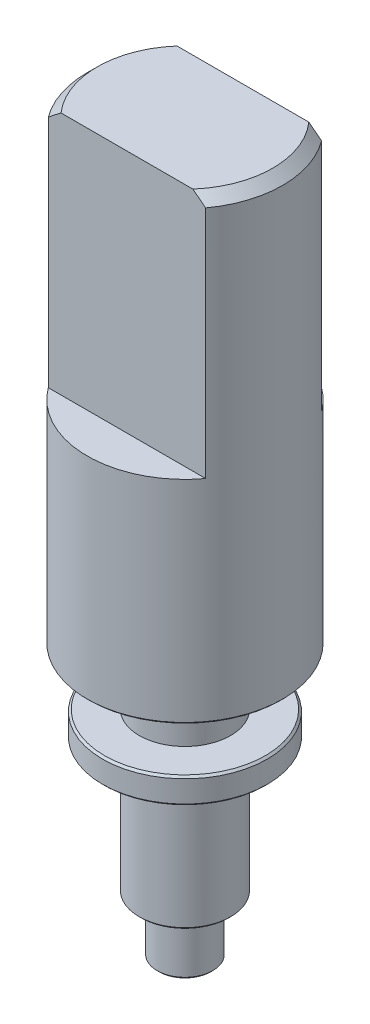
ISO-10303-21;
HEADER;
FILE_DESCRIPTION(('STEP AP214'),'2;1');
FILE_NAME('part.step','',(''),(''),'','','');
FILE_SCHEMA(('AUTOMOTIVE_DESIGN { 1 0 10303 214 1 1 1 1 }'));
ENDSEC;
DATA;
#1=APPLICATION_CONTEXT('core data for automotive mechanical design processes');
#2=APPLICATION_PROTOCOL_DEFINITION('international standard','automotive_design',2000,#1);
#3=PRODUCT_CONTEXT('',#1,'mechanical');
#4=PRODUCT('Part','Part','',(#3));
#5=PRODUCT_RELATED_PRODUCT_CATEGORY('part','',(#4));
#6=PRODUCT_DEFINITION_FORMATION('','',#4);
#7=PRODUCT_DEFINITION_CONTEXT('part definition',#1,'design');
#8=PRODUCT_DEFINITION('design','',#6,#7);
#9=PRODUCT_DEFINITION_SHAPE('','',#8);
#10=(LENGTH_UNIT() NAMED_UNIT(*) SI_UNIT(.MILLI.,.METRE.));
#11=(NAMED_UNIT(*) PLANE_ANGLE_UNIT() SI_UNIT($,.RADIAN.));
#12=(NAMED_UNIT(*) SI_UNIT($,.STERADIAN.) SOLID_ANGLE_UNIT());
#13=UNCERTAINTY_MEASURE_WITH_UNIT(LENGTH_MEASURE(1.E-05),#10,'distance_accuracy_value','');
#14=(GEOMETRIC_REPRESENTATION_CONTEXT(3) GLOBAL_UNCERTAINTY_ASSIGNED_CONTEXT((#13)) GLOBAL_UNIT_ASSIGNED_CONTEXT((#10,
#11,#12)) REPRESENTATION_CONTEXT('',''));
#15=CARTESIAN_POINT('',(0.,0.,0.));
#16=DIRECTION('',(0.,0.,1.));
#17=DIRECTION('',(1.,0.,0.));
#18=AXIS2_PLACEMENT_3D('',#15,#16,#17);
#19=CARTESIAN_POINT('',(-2.46,18.3,0.));
#20=DIRECTION('',(0.,1.,0.));
#21=DIRECTION('',(0.,0.,1.));
#22=AXIS2_PLACEMENT_3D('',#19,#20,#21);
#23=PLANE('',#22);
#24=DIRECTION('',(1.,0.,0.));
#25=VECTOR('',#24,1.);
#26=CARTESIAN_POINT('',(-1.97989898732233,18.3,-1.46));
#27=LINE('',#26,#25);
#28=CARTESIAN_POINT('',(-1.65906600230371,18.3,-1.46));
#29=VERTEX_POINT('',#28);
#30=CARTESIAN_POINT('',(1.65906600230371,18.3,-1.46));
#31=VERTEX_POINT('',#30);
#32=EDGE_CURVE('E97',#29,#31,#27,.T.);
#33=ORIENTED_EDGE('',*,*,#32,.F.);
#34=CARTESIAN_POINT('',(0.,18.3,0.));
#35=DIRECTION('',(0.,1.,0.));
#36=DIRECTION('',(0.,0.,1.));
#37=AXIS2_PLACEMENT_3D('',#34,#35,#36);
#38=CIRCLE('',#37,2.21);
#39=CARTESIAN_POINT('',(-1.65906600230371,18.3,1.46));
#40=VERTEX_POINT('',#39);
#41=EDGE_CURVE('E161',#29,#40,#38,.T.);
#42=ORIENTED_EDGE('',*,*,#41,.T.);
#43=DIRECTION('',(-1.,0.,0.));
#44=VECTOR('',#43,1.);
#45=CARTESIAN_POINT('',(-1.97989898732233,18.3,1.46));
#46=LINE('',#45,#44);
#47=CARTESIAN_POINT('',(1.65906600230371,18.3,1.46));
#48=VERTEX_POINT('',#47);
#49=EDGE_CURVE('E105',#48,#40,#46,.T.);
#50=ORIENTED_EDGE('',*,*,#49,.F.);
#51=CARTESIAN_POINT('',(0.,18.3,0.));
#52=DIRECTION('',(0.,1.,0.));
#53=DIRECTION('',(0.,0.,1.));
#54=AXIS2_PLACEMENT_3D('',#51,#52,#53);
#55=CIRCLE('',#54,2.21);
#56=EDGE_CURVE('E420',#48,#31,#55,.T.);
#57=ORIENTED_EDGE('',*,*,#56,.T.);
#58=EDGE_LOOP('',(#33,#42,#50,#57));
#59=FACE_BOUND('',#58,.T.);
#60=ADVANCED_FACE('F37',(#59),#23,.T.);
#61=CARTESIAN_POINT('',(0.,0.,0.));
#62=DIRECTION('',(0.,-1.,0.));
#63=DIRECTION('',(0.,0.,-1.));
#64=AXIS2_PLACEMENT_3D('',#61,#62,#63);
#65=PLANE('',#64);
#66=CARTESIAN_POINT('',(0.,0.,0.));
#67=DIRECTION('',(0.,-1.,0.));
#68=DIRECTION('',(0.,0.,-1.));
#69=AXIS2_PLACEMENT_3D('',#66,#67,#68);
#70=CIRCLE('',#69,0.649999999999996);
#71=CARTESIAN_POINT('',(0.,0.,-0.649999999999996));
#72=VERTEX_POINT('',#71);
#73=EDGE_CURVE('E12',#72,#72,#70,.T.);
#74=ORIENTED_EDGE('',*,*,#73,.T.);
#75=EDGE_LOOP('',(#74));
#76=FACE_BOUND('',#75,.T.);
#77=ADVANCED_FACE('F219',(#76),#65,.T.);
#78=CARTESIAN_POINT('',(0.,18.3,0.));
#79=DIRECTION('',(0.,1.,0.));
#80=DIRECTION('',(0.,0.,1.));
#81=AXIS2_PLACEMENT_3D('',#78,#79,#80);
#82=CYLINDRICAL_SURFACE('',#81,0.699999999999998);
#83=CARTESIAN_POINT('',(0.,0.0500000000000014,0.));
#84=DIRECTION('',(0.,-1.,0.));
#85=DIRECTION('',(0.,0.,-1.));
#86=AXIS2_PLACEMENT_3D('',#83,#84,#85);
#87=CIRCLE('',#86,0.699999999999998);
#88=CARTESIAN_POINT('',(0.,0.0500000000000014,-0.699999999999998));
#89=VERTEX_POINT('',#88);
#90=EDGE_CURVE('E46',#89,#89,#87,.F.);
#91=ORIENTED_EDGE('',*,*,#90,.T.);
#92=EDGE_LOOP('',(#91));
#93=FACE_BOUND('',#92,.T.);
#94=CARTESIAN_POINT('',(0.,1.4,0.));
#95=DIRECTION('',(0.,1.,0.));
#96=DIRECTION('',(0.,0.,1.));
#97=AXIS2_PLACEMENT_3D('',#94,#95,#96);
#98=CIRCLE('',#97,0.699999999999998);
#99=CARTESIAN_POINT('',(0.,1.4,0.699999999999998));
#100=VERTEX_POINT('',#99);
#101=EDGE_CURVE('E440',#100,#100,#98,.T.);
#102=ORIENTED_EDGE('',*,*,#101,.F.);
#103=EDGE_LOOP('',(#102));
#104=FACE_BOUND('',#103,.T.);
#105=ADVANCED_FACE('F215',(#93,#104),#82,.T.);
#106=CARTESIAN_POINT('',(-0.699999999999998,1.4,0.));
#107=DIRECTION('',(0.,-1.,0.));
#108=DIRECTION('',(0.,0.,-1.));
#109=AXIS2_PLACEMENT_3D('',#106,#107,#108);
#110=PLANE('',#109);
#111=CARTESIAN_POINT('',(0.,1.4,0.));
#112=DIRECTION('',(0.,-1.,0.));
#113=DIRECTION('',(0.,0.,-1.));
#114=AXIS2_PLACEMENT_3D('',#111,#112,#113);
#115=CIRCLE('',#114,1.1);
#116=CARTESIAN_POINT('',(0.,1.4,-1.1));
#117=VERTEX_POINT('',#116);
#118=EDGE_CURVE('E473',#117,#117,#115,.T.);
#119=ORIENTED_EDGE('',*,*,#118,.T.);
#120=EDGE_LOOP('',(#119));
#121=FACE_BOUND('',#120,.T.);
#122=ORIENTED_EDGE('',*,*,#101,.T.);
#123=EDGE_LOOP('',(#122));
#124=FACE_BOUND('',#123,.T.);
#125=ADVANCED_FACE('F211',(#121,#124),#110,.T.);
#126=CARTESIAN_POINT('',(0.,18.3,0.));
#127=DIRECTION('',(0.,1.,0.));
#128=DIRECTION('',(0.,0.,1.));
#129=AXIS2_PLACEMENT_3D('',#126,#127,#128);
#130=CYLINDRICAL_SURFACE('',#129,1.15);
#131=CARTESIAN_POINT('',(0.,1.45,0.));
#132=DIRECTION('',(0.,-1.,0.));
#133=DIRECTION('',(0.,0.,-1.));
#134=AXIS2_PLACEMENT_3D('',#131,#132,#133);
#135=CIRCLE('',#134,1.15);
#136=CARTESIAN_POINT('',(0.,1.45,-1.15));
#137=VERTEX_POINT('',#136);
#138=EDGE_CURVE('E454',#137,#137,#135,.F.);
#139=ORIENTED_EDGE('',*,*,#138,.T.);
#140=EDGE_LOOP('',(#139));
#141=FACE_BOUND('',#140,.T.);
#142=CARTESIAN_POINT('',(0.,4.75,0.));
#143=DIRECTION('',(0.,1.,0.));
#144=DIRECTION('',(0.,0.,1.));
#145=AXIS2_PLACEMENT_3D('',#142,#143,#144);
#146=CIRCLE('',#145,1.15);
#147=CARTESIAN_POINT('',(0.,4.75,1.15));
#148=VERTEX_POINT('',#147);
#149=EDGE_CURVE('E467',#148,#148,#146,.T.);
#150=ORIENTED_EDGE('',*,*,#149,.F.);
#151=EDGE_LOOP('',(#150));
#152=FACE_BOUND('',#151,.T.);
#153=ADVANCED_FACE('F207',(#141,#152),#130,.T.);
#154=CARTESIAN_POINT('',(-1.15,4.75,0.));
#155=DIRECTION('',(0.,-1.,0.));
#156=DIRECTION('',(0.,0.,-1.));
#157=AXIS2_PLACEMENT_3D('',#154,#155,#156);
#158=PLANE('',#157);
#159=CARTESIAN_POINT('',(0.,4.75,0.));
#160=DIRECTION('',(0.,-1.,0.));
#161=DIRECTION('',(0.,0.,-1.));
#162=AXIS2_PLACEMENT_3D('',#159,#160,#161);
#163=CIRCLE('',#162,2.025);
#164=CARTESIAN_POINT('',(0.,4.75,-2.025));
#165=VERTEX_POINT('',#164);
#166=EDGE_CURVE('E483',#165,#165,#163,.T.);
#167=ORIENTED_EDGE('',*,*,#166,.T.);
#168=EDGE_LOOP('',(#167));
#169=FACE_BOUND('',#168,.T.);
#170=ORIENTED_EDGE('',*,*,#149,.T.);
#171=EDGE_LOOP('',(#170));
#172=FACE_BOUND('',#171,.T.);
#173=ADVANCED_FACE('F203',(#169,#172),#158,.T.);
#174=CARTESIAN_POINT('',(0.,18.3,0.));
#175=DIRECTION('',(0.,1.,0.));
#176=DIRECTION('',(0.,0.,1.));
#177=AXIS2_PLACEMENT_3D('',#174,#175,#176);
#178=CYLINDRICAL_SURFACE('',#177,2.075);
#179=CARTESIAN_POINT('',(0.,5.35,0.));
#180=DIRECTION('',(0.,1.,0.));
#181=DIRECTION('',(0.,0.,1.));
#182=AXIS2_PLACEMENT_3D('',#179,#180,#181);
#183=CIRCLE('',#182,2.075);
#184=CARTESIAN_POINT('',(0.,5.35,2.075));
#185=VERTEX_POINT('',#184);
#186=EDGE_CURVE('E487',#185,#185,#183,.F.);
#187=ORIENTED_EDGE('',*,*,#186,.T.);
#188=EDGE_LOOP('',(#187));
#189=FACE_BOUND('',#188,.T.);
#190=CARTESIAN_POINT('',(0.,4.8,0.));
#191=DIRECTION('',(0.,-1.,0.));
#192=DIRECTION('',(0.,0.,-1.));
#193=AXIS2_PLACEMENT_3D('',#190,#191,#192);
#194=CIRCLE('',#193,2.075);
#195=CARTESIAN_POINT('',(0.,4.8,-2.075));
#196=VERTEX_POINT('',#195);
#197=EDGE_CURVE('E503',#196,#196,#194,.F.);
#198=ORIENTED_EDGE('',*,*,#197,.T.);
#199=EDGE_LOOP('',(#198));
#200=FACE_BOUND('',#199,.T.);
#201=ADVANCED_FACE('F199',(#189,#200),#178,.T.);
#202=CARTESIAN_POINT('',(-2.075,5.4,0.));
#203=DIRECTION('',(0.,1.,0.));
#204=DIRECTION('',(0.,0.,1.));
#205=AXIS2_PLACEMENT_3D('',#202,#203,#204);
#206=PLANE('',#205);
#207=CARTESIAN_POINT('',(0.,5.4,0.));
#208=DIRECTION('',(0.,1.,0.));
#209=DIRECTION('',(0.,0.,1.));
#210=AXIS2_PLACEMENT_3D('',#207,#208,#209);
#211=CIRCLE('',#210,2.025);
#212=CARTESIAN_POINT('',(0.,5.4,2.025));
#213=VERTEX_POINT('',#212);
#214=EDGE_CURVE('E476',#213,#213,#211,.T.);
#215=ORIENTED_EDGE('',*,*,#214,.T.);
#216=EDGE_LOOP('',(#215));
#217=FACE_BOUND('',#216,.T.);
#218=CARTESIAN_POINT('',(0.,5.4,0.));
#219=DIRECTION('',(0.,1.,0.));
#220=DIRECTION('',(0.,0.,1.));
#221=AXIS2_PLACEMENT_3D('',#218,#219,#220);
#222=CIRCLE('',#221,1.15);
#223=CARTESIAN_POINT('',(0.,5.4,1.15));
#224=VERTEX_POINT('',#223);
#225=EDGE_CURVE('E464',#224,#224,#222,.T.);
#226=ORIENTED_EDGE('',*,*,#225,.F.);
#227=EDGE_LOOP('',(#226));
#228=FACE_BOUND('',#227,.T.);
#229=ADVANCED_FACE('F195',(#217,#228),#206,.T.);
#230=CARTESIAN_POINT('',(0.,18.3,0.));
#231=DIRECTION('',(0.,1.,0.));
#232=DIRECTION('',(0.,0.,1.));
#233=AXIS2_PLACEMENT_3D('',#230,#231,#232);
#234=CYLINDRICAL_SURFACE('',#233,1.15);
#235=ORIENTED_EDGE('',*,*,#225,.T.);
#236=EDGE_LOOP('',(#235));
#237=FACE_BOUND('',#236,.T.);
#238=CARTESIAN_POINT('',(0.,6.8,0.));
#239=DIRECTION('',(0.,1.,0.));
#240=DIRECTION('',(0.,0.,1.));
#241=AXIS2_PLACEMENT_3D('',#238,#239,#240);
#242=CIRCLE('',#241,1.15);
#243=CARTESIAN_POINT('',(0.,6.8,1.15));
#244=VERTEX_POINT('',#243);
#245=EDGE_CURVE('E141',#244,#244,#242,.T.);
#246=ORIENTED_EDGE('',*,*,#245,.F.);
#247=EDGE_LOOP('',(#246));
#248=FACE_BOUND('',#247,.T.);
#249=ADVANCED_FACE('F191',(#237,#248),#234,.T.);
#250=CARTESIAN_POINT('',(-1.15,6.8,0.));
#251=DIRECTION('',(0.,-1.,0.));
#252=DIRECTION('',(0.,0.,-1.));
#253=AXIS2_PLACEMENT_3D('',#250,#251,#252);
#254=PLANE('',#253);
#255=CARTESIAN_POINT('',(0.,6.8,0.));
#256=DIRECTION('',(0.,-1.,0.));
#257=DIRECTION('',(0.,0.,-1.));
#258=AXIS2_PLACEMENT_3D('',#255,#256,#257);
#259=CIRCLE('',#258,2.40999999999999);
#260=CARTESIAN_POINT('',(0.,6.8,-2.40999999999999));
#261=VERTEX_POINT('',#260);
#262=EDGE_CURVE('E450',#261,#261,#259,.T.);
#263=ORIENTED_EDGE('',*,*,#262,.T.);
#264=EDGE_LOOP('',(#263));
#265=FACE_BOUND('',#264,.T.);
#266=ORIENTED_EDGE('',*,*,#245,.T.);
#267=EDGE_LOOP('',(#266));
#268=FACE_BOUND('',#267,.T.);
#269=ADVANCED_FACE('F187',(#265,#268),#254,.T.);
#270=CARTESIAN_POINT('',(0.,18.3,0.));
#271=DIRECTION('',(0.,1.,0.));
#272=DIRECTION('',(0.,0.,1.));
#273=AXIS2_PLACEMENT_3D('',#270,#271,#272);
#274=CYLINDRICAL_SURFACE('',#273,2.46);
#275=CARTESIAN_POINT('',(0.,6.85,0.));
#276=DIRECTION('',(0.,-1.,0.));
#277=DIRECTION('',(0.,0.,-1.));
#278=AXIS2_PLACEMENT_3D('',#275,#276,#277);
#279=CIRCLE('',#278,2.46);
#280=CARTESIAN_POINT('',(0.,6.85,-2.46));
#281=VERTEX_POINT('',#280);
#282=EDGE_CURVE('E239',#281,#281,#279,.F.);
#283=ORIENTED_EDGE('',*,*,#282,.T.);
#284=EDGE_LOOP('',(#283));
#285=FACE_BOUND('',#284,.T.);
#286=DIRECTION('',(0.,1.,0.));
#287=VECTOR('',#286,1.);
#288=CARTESIAN_POINT('',(-1.97989898732233,12.15,1.46));
#289=LINE('',#288,#287);
#290=CARTESIAN_POINT('',(-1.97989898732233,12.15,1.46));
#291=VERTEX_POINT('',#290);
#292=CARTESIAN_POINT('',(-1.97989898732233,18.05,1.46));
#293=VERTEX_POINT('',#292);
#294=EDGE_CURVE('E137',#291,#293,#289,.T.);
#295=ORIENTED_EDGE('',*,*,#294,.T.);
#296=CARTESIAN_POINT('',(0.,18.05,0.));
#297=DIRECTION('',(0.,1.,0.));
#298=DIRECTION('',(0.,0.,1.));
#299=AXIS2_PLACEMENT_3D('',#296,#297,#298);
#300=CIRCLE('',#299,2.46);
#301=CARTESIAN_POINT('',(-1.97989898732233,18.05,-1.46));
#302=VERTEX_POINT('',#301);
#303=EDGE_CURVE('E53',#293,#302,#300,.F.);
#304=ORIENTED_EDGE('',*,*,#303,.T.);
#305=DIRECTION('',(0.,1.,0.));
#306=VECTOR('',#305,1.);
#307=CARTESIAN_POINT('',(-1.97989898732233,12.15,-1.46));
#308=LINE('',#307,#306);
#309=CARTESIAN_POINT('',(-1.97989898732233,12.15,-1.46));
#310=VERTEX_POINT('',#309);
#311=EDGE_CURVE('E100',#310,#302,#308,.T.);
#312=ORIENTED_EDGE('',*,*,#311,.F.);
#313=CARTESIAN_POINT('',(0.,12.15,0.));
#314=DIRECTION('',(0.,1.,0.));
#315=DIRECTION('',(0.,0.,1.));
#316=AXIS2_PLACEMENT_3D('',#313,#314,#315);
#317=CIRCLE('',#316,2.46);
#318=CARTESIAN_POINT('',(1.97989898732233,12.15,-1.46));
#319=VERTEX_POINT('',#318);
#320=EDGE_CURVE('E93',#319,#310,#317,.T.);
#321=ORIENTED_EDGE('',*,*,#320,.F.);
#322=DIRECTION('',(0.,1.,0.));
#323=VECTOR('',#322,1.);
#324=CARTESIAN_POINT('',(1.97989898732233,12.15,-1.46));
#325=LINE('',#324,#323);
#326=CARTESIAN_POINT('',(1.97989898732233,18.05,-1.46));
#327=VERTEX_POINT('',#326);
#328=EDGE_CURVE('E102',#319,#327,#325,.T.);
#329=ORIENTED_EDGE('',*,*,#328,.T.);
#330=CARTESIAN_POINT('',(0.,18.05,0.));
#331=DIRECTION('',(0.,1.,0.));
#332=DIRECTION('',(0.,0.,1.));
#333=AXIS2_PLACEMENT_3D('',#330,#331,#332);
#334=CIRCLE('',#333,2.46);
#335=CARTESIAN_POINT('',(1.97989898732233,18.05,1.46));
#336=VERTEX_POINT('',#335);
#337=EDGE_CURVE('E413',#327,#336,#334,.F.);
#338=ORIENTED_EDGE('',*,*,#337,.T.);
#339=DIRECTION('',(0.,1.,0.));
#340=VECTOR('',#339,1.);
#341=CARTESIAN_POINT('',(1.97989898732233,12.15,1.46));
#342=LINE('',#341,#340);
#343=CARTESIAN_POINT('',(1.97989898732233,12.15,1.46));
#344=VERTEX_POINT('',#343);
#345=EDGE_CURVE('E133',#344,#336,#342,.T.);
#346=ORIENTED_EDGE('',*,*,#345,.F.);
#347=CARTESIAN_POINT('',(0.,12.15,0.));
#348=DIRECTION('',(0.,1.,0.));
#349=DIRECTION('',(0.,0.,1.));
#350=AXIS2_PLACEMENT_3D('',#347,#348,#349);
#351=CIRCLE('',#350,2.46);
#352=EDGE_CURVE('E111',#291,#344,#351,.T.);
#353=ORIENTED_EDGE('',*,*,#352,.F.);
#354=EDGE_LOOP('',(#295,#304,#312,#321,#329,#338,#346,#353));
#355=FACE_BOUND('',#354,.T.);
#356=ADVANCED_FACE('F103',(#285,#355),#274,.T.);
#357=CARTESIAN_POINT('',(-1.97989898732233,12.15,1.46));
#358=DIRECTION('',(0.,0.,-1.));
#359=DIRECTION('',(-1.,0.,0.));
#360=AXIS2_PLACEMENT_3D('',#357,#358,#359);
#361=PLANE('',#360);
#362=ORIENTED_EDGE('',*,*,#49,.T.);
#363=CARTESIAN_POINT('',(-1.65906600230371,18.3,1.46));
#364=CARTESIAN_POINT('',(-1.68617458978429,18.2796484395284,1.46));
#365=CARTESIAN_POINT('',(-1.71317928404995,18.2591590177984,1.46));
#366=CARTESIAN_POINT('',(-1.76699585580801,18.217932332114,1.46));
#367=CARTESIAN_POINT('',(-1.79380774678302,18.1971950857651,1.46));
#368=CARTESIAN_POINT('',(-1.84725720985176,18.1554979799921,1.46));
#369=CARTESIAN_POINT('',(-1.87389478387278,18.134538123036,1.46));
#370=CARTESIAN_POINT('',(-1.92701213315352,18.0924155188503,1.46));
#371=CARTESIAN_POINT('',(-1.95349189714086,18.0712527574024,1.46));
#372=CARTESIAN_POINT('',(-1.97989898732235,18.05,1.46));
#373=B_SPLINE_CURVE_WITH_KNOTS('',3,(#363,#364,#365,#366,#367,#368,#369,#370,#371,#372),
.UNSPECIFIED.,.F.,.F.,(4,2,2,2,4),(0.,0.101692536253413,0.203377890674927,0.305062118932271,
0.406753525481858),.UNSPECIFIED.);
#374=EDGE_CURVE('E160',#40,#293,#373,.T.);
#375=ORIENTED_EDGE('',*,*,#374,.T.);
#376=ORIENTED_EDGE('',*,*,#294,.F.);
#377=DIRECTION('',(-1.,0.,0.));
#378=VECTOR('',#377,1.);
#379=CARTESIAN_POINT('',(-1.97989898732233,12.15,1.46));
#380=LINE('',#379,#378);
#381=EDGE_CURVE('E138',#344,#291,#380,.T.);
#382=ORIENTED_EDGE('',*,*,#381,.F.);
#383=ORIENTED_EDGE('',*,*,#345,.T.);
#384=CARTESIAN_POINT('',(1.97989898732233,18.05,1.46));
#385=CARTESIAN_POINT('',(1.95349189714085,18.0712527574024,1.46));
#386=CARTESIAN_POINT('',(1.92701213315352,18.0924155188503,1.46));
#387=CARTESIAN_POINT('',(1.87389478387278,18.134538123036,1.46));
#388=CARTESIAN_POINT('',(1.84725720985176,18.1554979799921,1.46));
#389=CARTESIAN_POINT('',(1.79380774678302,18.1971950857651,1.46));
#390=CARTESIAN_POINT('',(1.76699585580801,18.2179323321139,1.46));
#391=CARTESIAN_POINT('',(1.71317928404995,18.2591590177984,1.46));
#392=CARTESIAN_POINT('',(1.6861745897843,18.2796484395284,1.46));
#393=CARTESIAN_POINT('',(1.65906600230374,18.3,1.46));
#394=B_SPLINE_CURVE_WITH_KNOTS('',3,(#384,#385,#386,#387,#388,#389,#390,#391,#392,#393),
.UNSPECIFIED.,.F.,.F.,(4,2,2,2,4),(0.,0.101691406549585,0.203375634806927,0.305060989228441,
0.406753525481854),.UNSPECIFIED.);
#395=EDGE_CURVE('E150',#336,#48,#394,.T.);
#396=ORIENTED_EDGE('',*,*,#395,.T.);
#397=EDGE_LOOP('',(#362,#375,#376,#382,#383,#396));
#398=FACE_BOUND('',#397,.T.);
#399=ADVANCED_FACE('F176',(#398),#361,.F.);
#400=CARTESIAN_POINT('',(0.,12.15,0.));
#401=DIRECTION('',(0.,1.,0.));
#402=DIRECTION('',(0.,0.,1.));
#403=AXIS2_PLACEMENT_3D('',#400,#401,#402);
#404=PLANE('',#403);
#405=ORIENTED_EDGE('',*,*,#352,.T.);
#406=ORIENTED_EDGE('',*,*,#381,.T.);
#407=EDGE_LOOP('',(#405,#406));
#408=FACE_BOUND('',#407,.T.);
#409=ADVANCED_FACE('F181',(#408),#404,.T.);
#410=CARTESIAN_POINT('',(-1.97989898732233,12.15,-1.46));
#411=DIRECTION('',(0.,0.,1.));
#412=DIRECTION('',(1.,0.,0.));
#413=AXIS2_PLACEMENT_3D('',#410,#411,#412);
#414=PLANE('',#413);
#415=ORIENTED_EDGE('',*,*,#311,.T.);
#416=CARTESIAN_POINT('',(-1.97989898732233,18.05,-1.46));
#417=CARTESIAN_POINT('',(-1.95349189714085,18.0712527574024,-1.46));
#418=CARTESIAN_POINT('',(-1.92701213315352,18.0924155188503,-1.46));
#419=CARTESIAN_POINT('',(-1.87389478387278,18.134538123036,-1.46));
#420=CARTESIAN_POINT('',(-1.84725720985176,18.1554979799921,-1.46));
#421=CARTESIAN_POINT('',(-1.79380774678302,18.1971950857651,-1.46));
#422=CARTESIAN_POINT('',(-1.76699585580801,18.2179323321139,-1.46));
#423=CARTESIAN_POINT('',(-1.71317928404996,18.2591590177984,-1.46));
#424=CARTESIAN_POINT('',(-1.6861745897843,18.2796484395284,-1.46));
#425=CARTESIAN_POINT('',(-1.65906600230374,18.3,-1.46));
#426=B_SPLINE_CURVE_WITH_KNOTS('',3,(#416,#417,#418,#419,#420,#421,#422,#423,#424,#425),
.UNSPECIFIED.,.F.,.F.,(4,2,2,2,4),(0.,0.101691406549585,0.203375634806927,0.305060989228437,
0.406753525481854),.UNSPECIFIED.);
#427=EDGE_CURVE('E232',#302,#29,#426,.T.);
#428=ORIENTED_EDGE('',*,*,#427,.T.);
#429=ORIENTED_EDGE('',*,*,#32,.T.);
#430=CARTESIAN_POINT('',(1.65906600230371,18.3,-1.46));
#431=CARTESIAN_POINT('',(1.68617458978429,18.2796484395284,-1.46));
#432=CARTESIAN_POINT('',(1.71317928404995,18.2591590177984,-1.46));
#433=CARTESIAN_POINT('',(1.76699585580801,18.217932332114,-1.46));
#434=CARTESIAN_POINT('',(1.79380774678302,18.1971950857651,-1.46));
#435=CARTESIAN_POINT('',(1.84725720985176,18.1554979799921,-1.46));
#436=CARTESIAN_POINT('',(1.87389478387278,18.134538123036,-1.46));
#437=CARTESIAN_POINT('',(1.92701213315352,18.0924155188503,-1.46));
#438=CARTESIAN_POINT('',(1.95349189714086,18.0712527574024,-1.46));
#439=CARTESIAN_POINT('',(1.97989898732235,18.05,-1.46));
#440=B_SPLINE_CURVE_WITH_KNOTS('',3,(#430,#431,#432,#433,#434,#435,#436,#437,#438,#439),
.UNSPECIFIED.,.F.,.F.,(4,2,2,2,4),(0.,0.101692536253413,0.203377890674927,0.305062118932271,
0.406753525481858),.UNSPECIFIED.);
#441=EDGE_CURVE('E61',#31,#327,#440,.T.);
#442=ORIENTED_EDGE('',*,*,#441,.T.);
#443=ORIENTED_EDGE('',*,*,#328,.F.);
#444=DIRECTION('',(1.,0.,0.));
#445=VECTOR('',#444,1.);
#446=CARTESIAN_POINT('',(-1.97989898732233,12.15,-1.46));
#447=LINE('',#446,#445);
#448=EDGE_CURVE('E96',#310,#319,#447,.T.);
#449=ORIENTED_EDGE('',*,*,#448,.F.);
#450=EDGE_LOOP('',(#415,#428,#429,#442,#443,#449));
#451=FACE_BOUND('',#450,.T.);
#452=ADVANCED_FACE('F99',(#451),#414,.F.);
#453=CARTESIAN_POINT('',(0.,12.15,0.));
#454=DIRECTION('',(0.,1.,0.));
#455=DIRECTION('',(0.,0.,1.));
#456=AXIS2_PLACEMENT_3D('',#453,#454,#455);
#457=PLANE('',#456);
#458=ORIENTED_EDGE('',*,*,#320,.T.);
#459=ORIENTED_EDGE('',*,*,#448,.T.);
#460=EDGE_LOOP('',(#458,#459));
#461=FACE_BOUND('',#460,.T.);
#462=ADVANCED_FACE('F95',(#461),#457,.T.);
#463=CARTESIAN_POINT('',(0.,18.3,0.));
#464=DIRECTION('',(0.,-1.,0.));
#465=DIRECTION('',(0.,0.,-1.));
#466=AXIS2_PLACEMENT_3D('',#463,#464,#465);
#467=CONICAL_SURFACE('',#466,2.21,0.785398163397447);
#468=ORIENTED_EDGE('',*,*,#427,.F.);
#469=ORIENTED_EDGE('',*,*,#303,.F.);
#470=ORIENTED_EDGE('',*,*,#374,.F.);
#471=ORIENTED_EDGE('',*,*,#41,.F.);
#472=EDGE_LOOP('',(#468,#469,#470,#471));
#473=FACE_BOUND('',#472,.T.);
#474=ADVANCED_FACE('F226',(#473),#467,.T.);
#475=CARTESIAN_POINT('',(0.,18.3,0.));
#476=DIRECTION('',(0.,-1.,0.));
#477=DIRECTION('',(0.,0.,-1.));
#478=AXIS2_PLACEMENT_3D('',#475,#476,#477);
#479=CONICAL_SURFACE('',#478,2.21,0.785398163397447);
#480=ORIENTED_EDGE('',*,*,#395,.F.);
#481=ORIENTED_EDGE('',*,*,#337,.F.);
#482=ORIENTED_EDGE('',*,*,#441,.F.);
#483=ORIENTED_EDGE('',*,*,#56,.F.);
#484=EDGE_LOOP('',(#480,#481,#482,#483));
#485=FACE_BOUND('',#484,.T.);
#486=ADVANCED_FACE('F173',(#485),#479,.T.);
#487=CARTESIAN_POINT('',(0.,6.85,0.));
#488=DIRECTION('',(0.,1.,0.));
#489=DIRECTION('',(0.,0.,1.));
#490=AXIS2_PLACEMENT_3D('',#487,#488,#489);
#491=CONICAL_SURFACE('',#490,2.46,0.785398163397461);
#492=ORIENTED_EDGE('',*,*,#262,.F.);
#493=EDGE_LOOP('',(#492));
#494=FACE_BOUND('',#493,.T.);
#495=ORIENTED_EDGE('',*,*,#282,.F.);
#496=EDGE_LOOP('',(#495));
#497=FACE_BOUND('',#496,.T.);
#498=ADVANCED_FACE('F271',(#494,#497),#491,.T.);
#499=CARTESIAN_POINT('',(0.,1.45,0.));
#500=DIRECTION('',(0.,1.,0.));
#501=DIRECTION('',(0.,0.,1.));
#502=AXIS2_PLACEMENT_3D('',#499,#500,#501);
#503=CONICAL_SURFACE('',#502,1.15,0.785398163397409);
#504=ORIENTED_EDGE('',*,*,#118,.F.);
#505=EDGE_LOOP('',(#504));
#506=FACE_BOUND('',#505,.T.);
#507=ORIENTED_EDGE('',*,*,#138,.F.);
#508=EDGE_LOOP('',(#507));
#509=FACE_BOUND('',#508,.T.);
#510=ADVANCED_FACE('F279',(#506,#509),#503,.T.);
#511=CARTESIAN_POINT('',(0.,5.4,0.));
#512=DIRECTION('',(0.,-1.,0.));
#513=DIRECTION('',(0.,0.,-1.));
#514=AXIS2_PLACEMENT_3D('',#511,#512,#513);
#515=CONICAL_SURFACE('',#514,2.025,0.78539816339744);
#516=ORIENTED_EDGE('',*,*,#186,.F.);
#517=EDGE_LOOP('',(#516));
#518=FACE_BOUND('',#517,.T.);
#519=ORIENTED_EDGE('',*,*,#214,.F.);
#520=EDGE_LOOP('',(#519));
#521=FACE_BOUND('',#520,.T.);
#522=ADVANCED_FACE('F287',(#518,#521),#515,.T.);
#523=CARTESIAN_POINT('',(0.,4.8,0.));
#524=DIRECTION('',(0.,1.,0.));
#525=DIRECTION('',(0.,0.,1.));
#526=AXIS2_PLACEMENT_3D('',#523,#524,#525);
#527=CONICAL_SURFACE('',#526,2.075,0.785398163397457);
#528=ORIENTED_EDGE('',*,*,#166,.F.);
#529=EDGE_LOOP('',(#528));
#530=FACE_BOUND('',#529,.T.);
#531=ORIENTED_EDGE('',*,*,#197,.F.);
#532=EDGE_LOOP('',(#531));
#533=FACE_BOUND('',#532,.T.);
#534=ADVANCED_FACE('F295',(#530,#533),#527,.T.);
#535=CARTESIAN_POINT('',(0.,0.0500000000000014,0.));
#536=DIRECTION('',(0.,1.,0.));
#537=DIRECTION('',(0.,0.,1.));
#538=AXIS2_PLACEMENT_3D('',#535,#536,#537);
#539=CONICAL_SURFACE('',#538,0.699999999999998,0.78539816339745);
#540=ORIENTED_EDGE('',*,*,#73,.F.);
#541=EDGE_LOOP('',(#540));
#542=FACE_BOUND('',#541,.T.);
#543=ORIENTED_EDGE('',*,*,#90,.F.);
#544=EDGE_LOOP('',(#543));
#545=FACE_BOUND('',#544,.T.);
#546=ADVANCED_FACE('F39',(#542,#545),#539,.T.);
#547=CLOSED_SHELL('',(#60,#77,#105,#125,#153,#173,#201,#229,#249,#269,#356,#399,#409,#452,#462,
#474,#486,#498,#510,#522,#534,#546));
#548=MANIFOLD_SOLID_BREP('B2',#547);
#549=ADVANCED_BREP_SHAPE_REPRESENTATION('',(#18,#548),#14);
#550=SHAPE_DEFINITION_REPRESENTATION(#9,#549);
ENDSEC;
END-ISO-10303-21;
